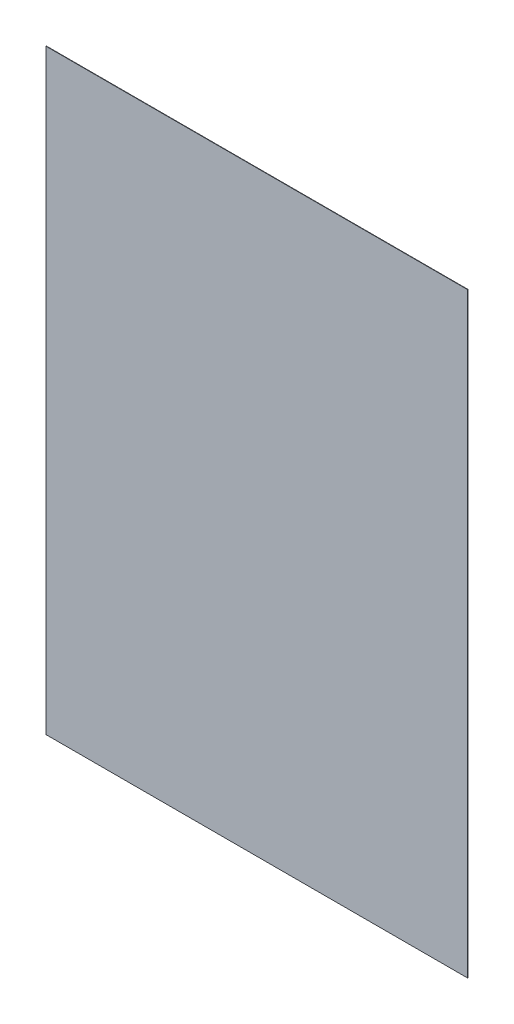
ISO-10303-21;
HEADER;
FILE_DESCRIPTION(('STEP AP214'),'2;1');
FILE_NAME('part.step','',(''),(''),'','','');
FILE_SCHEMA(('AUTOMOTIVE_DESIGN { 1 0 10303 214 1 1 1 1 }'));
ENDSEC;
DATA;
#1=APPLICATION_CONTEXT('core data for automotive mechanical design processes');
#2=APPLICATION_PROTOCOL_DEFINITION('international standard','automotive_design',2000,#1);
#3=PRODUCT_CONTEXT('',#1,'mechanical');
#4=PRODUCT('Part','Part','',(#3));
#5=PRODUCT_RELATED_PRODUCT_CATEGORY('part','',(#4));
#6=PRODUCT_DEFINITION_FORMATION('','',#4);
#7=PRODUCT_DEFINITION_CONTEXT('part definition',#1,'design');
#8=PRODUCT_DEFINITION('design','',#6,#7);
#9=PRODUCT_DEFINITION_SHAPE('','',#8);
#10=(LENGTH_UNIT() NAMED_UNIT(*) SI_UNIT(.MILLI.,.METRE.));
#11=(NAMED_UNIT(*) PLANE_ANGLE_UNIT() SI_UNIT($,.RADIAN.));
#12=(NAMED_UNIT(*) SI_UNIT($,.STERADIAN.) SOLID_ANGLE_UNIT());
#13=UNCERTAINTY_MEASURE_WITH_UNIT(LENGTH_MEASURE(1.E-05),#10,'distance_accuracy_value','');
#14=(GEOMETRIC_REPRESENTATION_CONTEXT(3) GLOBAL_UNCERTAINTY_ASSIGNED_CONTEXT((#13)) GLOBAL_UNIT_ASSIGNED_CONTEXT((#10,
#11,#12)) REPRESENTATION_CONTEXT('',''));
#15=CARTESIAN_POINT('',(0.,0.,0.));
#16=DIRECTION('',(0.,0.,1.));
#17=DIRECTION('',(1.,0.,0.));
#18=AXIS2_PLACEMENT_3D('',#15,#16,#17);
#19=CARTESIAN_POINT('',(105.,-148.5,0.2));
#20=DIRECTION('',(-1.,0.,0.));
#21=DIRECTION('',(0.,0.,1.));
#22=AXIS2_PLACEMENT_3D('',#19,#20,#21);
#23=PLANE('',#22);
#24=DIRECTION('',(0.,1.,0.));
#25=VECTOR('',#24,1.);
#26=CARTESIAN_POINT('',(105.,-148.5,0.));
#27=LINE('',#26,#25);
#28=CARTESIAN_POINT('',(105.,-148.5,0.));
#29=VERTEX_POINT('',#28);
#30=CARTESIAN_POINT('',(105.,148.5,0.));
#31=VERTEX_POINT('',#30);
#32=EDGE_CURVE('E95',#29,#31,#27,.T.);
#33=ORIENTED_EDGE('',*,*,#32,.T.);
#34=DIRECTION('',(0.,0.,-1.));
#35=VECTOR('',#34,1.);
#36=CARTESIAN_POINT('',(105.,148.5,0.2));
#37=LINE('',#36,#35);
#38=CARTESIAN_POINT('',(105.,148.5,0.2));
#39=VERTEX_POINT('',#38);
#40=EDGE_CURVE('E11',#39,#31,#37,.T.);
#41=ORIENTED_EDGE('',*,*,#40,.F.);
#42=DIRECTION('',(0.,1.,0.));
#43=VECTOR('',#42,1.);
#44=CARTESIAN_POINT('',(105.,-148.5,0.2));
#45=LINE('',#44,#43);
#46=CARTESIAN_POINT('',(105.,-148.5,0.2));
#47=VERTEX_POINT('',#46);
#48=EDGE_CURVE('E83',#47,#39,#45,.T.);
#49=ORIENTED_EDGE('',*,*,#48,.F.);
#50=DIRECTION('',(0.,0.,-1.));
#51=VECTOR('',#50,1.);
#52=CARTESIAN_POINT('',(105.,-148.5,0.2));
#53=LINE('',#52,#51);
#54=EDGE_CURVE('E91',#47,#29,#53,.T.);
#55=ORIENTED_EDGE('',*,*,#54,.T.);
#56=EDGE_LOOP('',(#33,#41,#49,#55));
#57=FACE_BOUND('',#56,.T.);
#58=ADVANCED_FACE('F32',(#57),#23,.F.);
#59=CARTESIAN_POINT('',(-105.,148.5,0.2));
#60=DIRECTION('',(0.,-1.,0.));
#61=DIRECTION('',(0.,0.,-1.));
#62=AXIS2_PLACEMENT_3D('',#59,#60,#61);
#63=PLANE('',#62);
#64=DIRECTION('',(-1.,0.,0.));
#65=VECTOR('',#64,1.);
#66=CARTESIAN_POINT('',(-105.,148.5,0.));
#67=LINE('',#66,#65);
#68=CARTESIAN_POINT('',(-105.,148.5,0.));
#69=VERTEX_POINT('',#68);
#70=EDGE_CURVE('E87',#31,#69,#67,.T.);
#71=ORIENTED_EDGE('',*,*,#70,.T.);
#72=DIRECTION('',(0.,0.,-1.));
#73=VECTOR('',#72,1.);
#74=CARTESIAN_POINT('',(-105.,148.5,0.2));
#75=LINE('',#74,#73);
#76=CARTESIAN_POINT('',(-105.,148.5,0.2));
#77=VERTEX_POINT('',#76);
#78=EDGE_CURVE('E40',#77,#69,#75,.T.);
#79=ORIENTED_EDGE('',*,*,#78,.F.);
#80=DIRECTION('',(-1.,0.,0.));
#81=VECTOR('',#80,1.);
#82=CARTESIAN_POINT('',(-105.,148.5,0.2));
#83=LINE('',#82,#81);
#84=EDGE_CURVE('E78',#39,#77,#83,.T.);
#85=ORIENTED_EDGE('',*,*,#84,.F.);
#86=ORIENTED_EDGE('',*,*,#40,.T.);
#87=EDGE_LOOP('',(#71,#79,#85,#86));
#88=FACE_BOUND('',#87,.T.);
#89=ADVANCED_FACE('F86',(#88),#63,.F.);
#90=CARTESIAN_POINT('',(-105.,-148.5,0.2));
#91=DIRECTION('',(1.,0.,0.));
#92=DIRECTION('',(0.,0.,-1.));
#93=AXIS2_PLACEMENT_3D('',#90,#91,#92);
#94=PLANE('',#93);
#95=DIRECTION('',(0.,-1.,0.));
#96=VECTOR('',#95,1.);
#97=CARTESIAN_POINT('',(-105.,-148.5,0.));
#98=LINE('',#97,#96);
#99=CARTESIAN_POINT('',(-105.,-148.5,0.));
#100=VERTEX_POINT('',#99);
#101=EDGE_CURVE('E65',#69,#100,#98,.T.);
#102=ORIENTED_EDGE('',*,*,#101,.T.);
#103=DIRECTION('',(0.,0.,-1.));
#104=VECTOR('',#103,1.);
#105=CARTESIAN_POINT('',(-105.,-148.5,0.2));
#106=LINE('',#105,#104);
#107=CARTESIAN_POINT('',(-105.,-148.5,0.2));
#108=VERTEX_POINT('',#107);
#109=EDGE_CURVE('E88',#108,#100,#106,.T.);
#110=ORIENTED_EDGE('',*,*,#109,.F.);
#111=DIRECTION('',(0.,-1.,0.));
#112=VECTOR('',#111,1.);
#113=CARTESIAN_POINT('',(-105.,-148.5,0.2));
#114=LINE('',#113,#112);
#115=EDGE_CURVE('E81',#77,#108,#114,.T.);
#116=ORIENTED_EDGE('',*,*,#115,.F.);
#117=ORIENTED_EDGE('',*,*,#78,.T.);
#118=EDGE_LOOP('',(#102,#110,#116,#117));
#119=FACE_BOUND('',#118,.T.);
#120=ADVANCED_FACE('F89',(#119),#94,.F.);
#121=CARTESIAN_POINT('',(-105.,-148.5,0.2));
#122=DIRECTION('',(0.,1.,0.));
#123=DIRECTION('',(0.,0.,1.));
#124=AXIS2_PLACEMENT_3D('',#121,#122,#123);
#125=PLANE('',#124);
#126=DIRECTION('',(1.,0.,0.));
#127=VECTOR('',#126,1.);
#128=CARTESIAN_POINT('',(-105.,-148.5,0.));
#129=LINE('',#128,#127);
#130=EDGE_CURVE('E71',#100,#29,#129,.T.);
#131=ORIENTED_EDGE('',*,*,#130,.T.);
#132=ORIENTED_EDGE('',*,*,#54,.F.);
#133=DIRECTION('',(1.,0.,0.));
#134=VECTOR('',#133,1.);
#135=CARTESIAN_POINT('',(-105.,-148.5,0.2));
#136=LINE('',#135,#134);
#137=EDGE_CURVE('E48',#108,#47,#136,.T.);
#138=ORIENTED_EDGE('',*,*,#137,.F.);
#139=ORIENTED_EDGE('',*,*,#109,.T.);
#140=EDGE_LOOP('',(#131,#132,#138,#139));
#141=FACE_BOUND('',#140,.T.);
#142=ADVANCED_FACE('F102',(#141),#125,.F.);
#143=CARTESIAN_POINT('',(0.,0.,0.2));
#144=DIRECTION('',(0.,0.,-1.));
#145=DIRECTION('',(-1.,0.,0.));
#146=AXIS2_PLACEMENT_3D('',#143,#144,#145);
#147=PLANE('',#146);
#148=ORIENTED_EDGE('',*,*,#48,.T.);
#149=ORIENTED_EDGE('',*,*,#84,.T.);
#150=ORIENTED_EDGE('',*,*,#115,.T.);
#151=ORIENTED_EDGE('',*,*,#137,.T.);
#152=EDGE_LOOP('',(#148,#149,#150,#151));
#153=FACE_BOUND('',#152,.T.);
#154=ADVANCED_FACE('F79',(#153),#147,.F.);
#155=CARTESIAN_POINT('',(0.,0.,0.));
#156=DIRECTION('',(0.,0.,-1.));
#157=DIRECTION('',(-1.,0.,0.));
#158=AXIS2_PLACEMENT_3D('',#155,#156,#157);
#159=PLANE('',#158);
#160=ORIENTED_EDGE('',*,*,#32,.F.);
#161=ORIENTED_EDGE('',*,*,#130,.F.);
#162=ORIENTED_EDGE('',*,*,#101,.F.);
#163=ORIENTED_EDGE('',*,*,#70,.F.);
#164=EDGE_LOOP('',(#160,#161,#162,#163));
#165=FACE_BOUND('',#164,.T.);
#166=ADVANCED_FACE('F105',(#165),#159,.T.);
#167=CLOSED_SHELL('',(#58,#89,#120,#142,#154,#166));
#168=MANIFOLD_SOLID_BREP('B2',#167);
#169=ADVANCED_BREP_SHAPE_REPRESENTATION('',(#18,#168),#14);
#170=SHAPE_DEFINITION_REPRESENTATION(#9,#169);
ENDSEC;
END-ISO-10303-21;
